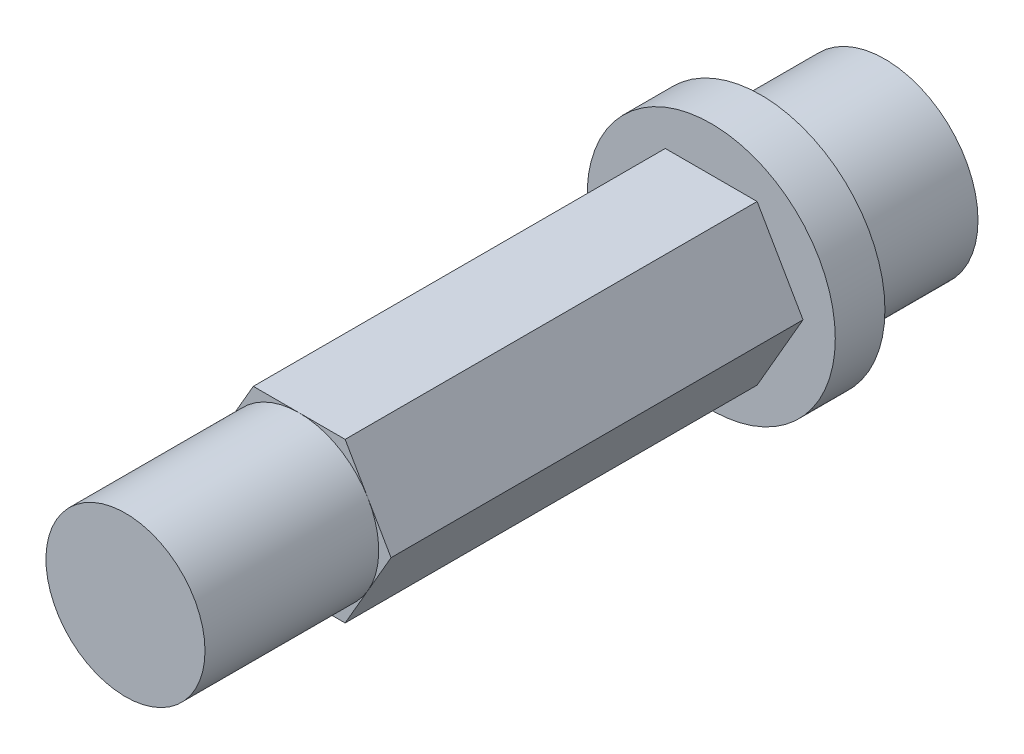
ISO-10303-21;
HEADER;
FILE_DESCRIPTION(('STEP AP214'),'2;1');
FILE_NAME('part.step','',(''),(''),'','','');
FILE_SCHEMA(('AUTOMOTIVE_DESIGN { 1 0 10303 214 1 1 1 1 }'));
ENDSEC;
DATA;
#1=APPLICATION_CONTEXT('core data for automotive mechanical design processes');
#2=APPLICATION_PROTOCOL_DEFINITION('international standard','automotive_design',2000,#1);
#3=PRODUCT_CONTEXT('',#1,'mechanical');
#4=PRODUCT('Part','Part','',(#3));
#5=PRODUCT_RELATED_PRODUCT_CATEGORY('part','',(#4));
#6=PRODUCT_DEFINITION_FORMATION('','',#4);
#7=PRODUCT_DEFINITION_CONTEXT('part definition',#1,'design');
#8=PRODUCT_DEFINITION('design','',#6,#7);
#9=PRODUCT_DEFINITION_SHAPE('','',#8);
#10=(LENGTH_UNIT() NAMED_UNIT(*) SI_UNIT(.MILLI.,.METRE.));
#11=(NAMED_UNIT(*) PLANE_ANGLE_UNIT() SI_UNIT($,.RADIAN.));
#12=(NAMED_UNIT(*) SI_UNIT($,.STERADIAN.) SOLID_ANGLE_UNIT());
#13=UNCERTAINTY_MEASURE_WITH_UNIT(LENGTH_MEASURE(1.E-05),#10,'distance_accuracy_value','');
#14=(GEOMETRIC_REPRESENTATION_CONTEXT(3) GLOBAL_UNCERTAINTY_ASSIGNED_CONTEXT((#13)) GLOBAL_UNIT_ASSIGNED_CONTEXT((#10,
#11,#12)) REPRESENTATION_CONTEXT('',''));
#15=CARTESIAN_POINT('',(0.,0.,0.));
#16=DIRECTION('',(0.,0.,1.));
#17=DIRECTION('',(1.,0.,0.));
#18=AXIS2_PLACEMENT_3D('',#15,#16,#17);
#19=CARTESIAN_POINT('',(0.,0.,23.6));
#20=DIRECTION('',(0.,0.,1.));
#21=DIRECTION('',(1.,0.,0.));
#22=AXIS2_PLACEMENT_3D('',#19,#20,#21);
#23=PLANE('',#22);
#24=CARTESIAN_POINT('',(0.,0.,23.6));
#25=DIRECTION('',(0.,0.,1.));
#26=DIRECTION('',(1.,0.,0.));
#27=AXIS2_PLACEMENT_3D('',#24,#25,#26);
#28=CIRCLE('',#27,3.20429399400242);
#29=CARTESIAN_POINT('',(2.775,1.60214699700121,23.6));
#30=VERTEX_POINT('',#29);
#31=CARTESIAN_POINT('',(0.,3.20429399400243,23.6));
#32=VERTEX_POINT('',#31);
#33=EDGE_CURVE('E51',#30,#32,#28,.T.);
#34=ORIENTED_EDGE('',*,*,#33,.F.);
#35=DIRECTION('',(-0.5,0.866025403784439,0.));
#36=VECTOR('',#35,1.);
#37=CARTESIAN_POINT('',(3.7,0.,23.6));
#38=LINE('',#37,#36);
#39=CARTESIAN_POINT('',(1.85,3.20429399400242,23.6));
#40=VERTEX_POINT('',#39);
#41=EDGE_CURVE('E127',#30,#40,#38,.T.);
#42=ORIENTED_EDGE('',*,*,#41,.T.);
#43=DIRECTION('',(-1.,0.,0.));
#44=VECTOR('',#43,1.);
#45=CARTESIAN_POINT('',(1.85,3.20429399400242,23.6));
#46=LINE('',#45,#44);
#47=EDGE_CURVE('E141',#40,#32,#46,.T.);
#48=ORIENTED_EDGE('',*,*,#47,.T.);
#49=EDGE_LOOP('',(#34,#42,#48));
#50=FACE_BOUND('',#49,.T.);
#51=ADVANCED_FACE('F39',(#50),#23,.T.);
#52=CARTESIAN_POINT('',(-2.775,1.60214699700121,23.6));
#53=VERTEX_POINT('',#52);
#54=EDGE_CURVE('E11',#32,#53,#28,.T.);
#55=ORIENTED_EDGE('',*,*,#54,.F.);
#56=CARTESIAN_POINT('',(-1.85,3.20429399400243,23.6));
#57=VERTEX_POINT('',#56);
#58=EDGE_CURVE('E126',#32,#57,#46,.T.);
#59=ORIENTED_EDGE('',*,*,#58,.T.);
#60=DIRECTION('',(-0.5,-0.866025403784439,0.));
#61=VECTOR('',#60,1.);
#62=CARTESIAN_POINT('',(-1.85,3.20429399400243,23.6));
#63=LINE('',#62,#61);
#64=EDGE_CURVE('E158',#57,#53,#63,.T.);
#65=ORIENTED_EDGE('',*,*,#64,.T.);
#66=EDGE_LOOP('',(#55,#59,#65));
#67=FACE_BOUND('',#66,.T.);
#68=ADVANCED_FACE('F242',(#67),#23,.T.);
#69=CARTESIAN_POINT('',(-2.775,-1.60214699700121,23.6));
#70=VERTEX_POINT('',#69);
#71=EDGE_CURVE('E49',#53,#70,#28,.T.);
#72=ORIENTED_EDGE('',*,*,#71,.F.);
#73=CARTESIAN_POINT('',(-3.7,0.,23.6));
#74=VERTEX_POINT('',#73);
#75=EDGE_CURVE('E157',#53,#74,#63,.T.);
#76=ORIENTED_EDGE('',*,*,#75,.T.);
#77=DIRECTION('',(0.5,-0.866025403784439,0.));
#78=VECTOR('',#77,1.);
#79=CARTESIAN_POINT('',(-3.7,0.,23.6));
#80=LINE('',#79,#78);
#81=EDGE_CURVE('E163',#74,#70,#80,.T.);
#82=ORIENTED_EDGE('',*,*,#81,.T.);
#83=EDGE_LOOP('',(#72,#76,#82));
#84=FACE_BOUND('',#83,.T.);
#85=ADVANCED_FACE('F247',(#84),#23,.T.);
#86=CARTESIAN_POINT('',(0.,-3.20429399400242,23.6));
#87=VERTEX_POINT('',#86);
#88=EDGE_CURVE('E66',#70,#87,#28,.T.);
#89=ORIENTED_EDGE('',*,*,#88,.F.);
#90=CARTESIAN_POINT('',(-1.85,-3.20429399400242,23.6));
#91=VERTEX_POINT('',#90);
#92=EDGE_CURVE('E162',#70,#91,#80,.T.);
#93=ORIENTED_EDGE('',*,*,#92,.T.);
#94=DIRECTION('',(1.,0.,0.));
#95=VECTOR('',#94,1.);
#96=CARTESIAN_POINT('',(-1.85,-3.20429399400242,23.6));
#97=LINE('',#96,#95);
#98=EDGE_CURVE('E168',#91,#87,#97,.T.);
#99=ORIENTED_EDGE('',*,*,#98,.T.);
#100=EDGE_LOOP('',(#89,#93,#99));
#101=FACE_BOUND('',#100,.T.);
#102=ADVANCED_FACE('F263',(#101),#23,.T.);
#103=CARTESIAN_POINT('',(2.775,-1.60214699700121,23.6));
#104=VERTEX_POINT('',#103);
#105=EDGE_CURVE('E58',#87,#104,#28,.T.);
#106=ORIENTED_EDGE('',*,*,#105,.F.);
#107=CARTESIAN_POINT('',(1.85,-3.20429399400243,23.6));
#108=VERTEX_POINT('',#107);
#109=EDGE_CURVE('E167',#87,#108,#97,.T.);
#110=ORIENTED_EDGE('',*,*,#109,.T.);
#111=DIRECTION('',(0.5,0.866025403784439,0.));
#112=VECTOR('',#111,1.);
#113=CARTESIAN_POINT('',(1.85,-3.20429399400243,23.6));
#114=LINE('',#113,#112);
#115=EDGE_CURVE('E139',#108,#104,#114,.T.);
#116=ORIENTED_EDGE('',*,*,#115,.T.);
#117=EDGE_LOOP('',(#106,#110,#116));
#118=FACE_BOUND('',#117,.T.);
#119=ADVANCED_FACE('F253',(#118),#23,.T.);
#120=CARTESIAN_POINT('',(0.,0.,5.));
#121=DIRECTION('',(0.,0.,-1.));
#122=DIRECTION('',(-1.,0.,0.));
#123=AXIS2_PLACEMENT_3D('',#120,#121,#122);
#124=CYLINDRICAL_SURFACE('',#123,3.75);
#125=CARTESIAN_POINT('',(0.,0.,5.));
#126=DIRECTION('',(0.,0.,1.));
#127=DIRECTION('',(1.,0.,0.));
#128=AXIS2_PLACEMENT_3D('',#125,#126,#127);
#129=CIRCLE('',#128,3.75);
#130=CARTESIAN_POINT('',(3.75,0.,5.));
#131=VERTEX_POINT('',#130);
#132=EDGE_CURVE('E147',#131,#131,#129,.T.);
#133=ORIENTED_EDGE('',*,*,#132,.F.);
#134=EDGE_LOOP('',(#133));
#135=FACE_BOUND('',#134,.T.);
#136=CARTESIAN_POINT('',(0.,0.,0.));
#137=DIRECTION('',(0.,0.,1.));
#138=DIRECTION('',(1.,0.,0.));
#139=AXIS2_PLACEMENT_3D('',#136,#137,#138);
#140=CIRCLE('',#139,3.75);
#141=CARTESIAN_POINT('',(3.75,0.,0.));
#142=VERTEX_POINT('',#141);
#143=EDGE_CURVE('E43',#142,#142,#140,.T.);
#144=ORIENTED_EDGE('',*,*,#143,.T.);
#145=EDGE_LOOP('',(#144));
#146=FACE_BOUND('',#145,.T.);
#147=ADVANCED_FACE('F41',(#135,#146),#124,.T.);
#148=CARTESIAN_POINT('',(0.,0.,0.));
#149=DIRECTION('',(0.,0.,1.));
#150=DIRECTION('',(1.,0.,0.));
#151=AXIS2_PLACEMENT_3D('',#148,#149,#150);
#152=PLANE('',#151);
#153=ORIENTED_EDGE('',*,*,#143,.F.);
#154=EDGE_LOOP('',(#153));
#155=FACE_BOUND('',#154,.T.);
#156=ADVANCED_FACE('F268',(#155),#152,.F.);
#157=CARTESIAN_POINT('',(0.,0.,7.));
#158=DIRECTION('',(0.,0.,-1.));
#159=DIRECTION('',(-1.,0.,0.));
#160=AXIS2_PLACEMENT_3D('',#157,#158,#159);
#161=CYLINDRICAL_SURFACE('',#160,5.);
#162=CARTESIAN_POINT('',(0.,0.,7.));
#163=DIRECTION('',(0.,0.,1.));
#164=DIRECTION('',(1.,0.,0.));
#165=AXIS2_PLACEMENT_3D('',#162,#163,#164);
#166=CIRCLE('',#165,5.);
#167=CARTESIAN_POINT('',(5.,0.,7.));
#168=VERTEX_POINT('',#167);
#169=EDGE_CURVE('E216',#168,#168,#166,.T.);
#170=ORIENTED_EDGE('',*,*,#169,.F.);
#171=EDGE_LOOP('',(#170));
#172=FACE_BOUND('',#171,.T.);
#173=CARTESIAN_POINT('',(0.,0.,5.));
#174=DIRECTION('',(0.,0.,1.));
#175=DIRECTION('',(1.,0.,0.));
#176=AXIS2_PLACEMENT_3D('',#173,#174,#175);
#177=CIRCLE('',#176,5.);
#178=CARTESIAN_POINT('',(5.,0.,5.));
#179=VERTEX_POINT('',#178);
#180=EDGE_CURVE('E215',#179,#179,#177,.T.);
#181=ORIENTED_EDGE('',*,*,#180,.T.);
#182=EDGE_LOOP('',(#181));
#183=FACE_BOUND('',#182,.T.);
#184=ADVANCED_FACE('F224',(#172,#183),#161,.T.);
#185=CARTESIAN_POINT('',(0.,0.,7.));
#186=DIRECTION('',(0.,0.,1.));
#187=DIRECTION('',(1.,0.,0.));
#188=AXIS2_PLACEMENT_3D('',#185,#186,#187);
#189=PLANE('',#188);
#190=DIRECTION('',(0.5,0.866025403784439,0.));
#191=VECTOR('',#190,1.);
#192=CARTESIAN_POINT('',(1.85,-3.20429399400243,7.));
#193=LINE('',#192,#191);
#194=CARTESIAN_POINT('',(1.85,-3.20429399400243,7.));
#195=VERTEX_POINT('',#194);
#196=CARTESIAN_POINT('',(3.7,0.,7.));
#197=VERTEX_POINT('',#196);
#198=EDGE_CURVE('E172',#195,#197,#193,.T.);
#199=ORIENTED_EDGE('',*,*,#198,.F.);
#200=DIRECTION('',(1.,0.,0.));
#201=VECTOR('',#200,1.);
#202=CARTESIAN_POINT('',(-1.85,-3.20429399400242,7.));
#203=LINE('',#202,#201);
#204=CARTESIAN_POINT('',(-1.85,-3.20429399400242,7.));
#205=VERTEX_POINT('',#204);
#206=EDGE_CURVE('E191',#205,#195,#203,.T.);
#207=ORIENTED_EDGE('',*,*,#206,.F.);
#208=DIRECTION('',(0.5,-0.866025403784439,0.));
#209=VECTOR('',#208,1.);
#210=CARTESIAN_POINT('',(-3.7,0.,7.));
#211=LINE('',#210,#209);
#212=CARTESIAN_POINT('',(-3.7,0.,7.));
#213=VERTEX_POINT('',#212);
#214=EDGE_CURVE('E187',#213,#205,#211,.T.);
#215=ORIENTED_EDGE('',*,*,#214,.F.);
#216=DIRECTION('',(-0.5,-0.866025403784439,0.));
#217=VECTOR('',#216,1.);
#218=CARTESIAN_POINT('',(-1.85,3.20429399400243,7.));
#219=LINE('',#218,#217);
#220=CARTESIAN_POINT('',(-1.85,3.20429399400243,7.));
#221=VERTEX_POINT('',#220);
#222=EDGE_CURVE('E183',#221,#213,#219,.T.);
#223=ORIENTED_EDGE('',*,*,#222,.F.);
#224=DIRECTION('',(-1.,0.,0.));
#225=VECTOR('',#224,1.);
#226=CARTESIAN_POINT('',(1.85,3.20429399400242,7.));
#227=LINE('',#226,#225);
#228=CARTESIAN_POINT('',(1.85,3.20429399400242,7.));
#229=VERTEX_POINT('',#228);
#230=EDGE_CURVE('E179',#229,#221,#227,.T.);
#231=ORIENTED_EDGE('',*,*,#230,.F.);
#232=DIRECTION('',(-0.5,0.866025403784439,0.));
#233=VECTOR('',#232,1.);
#234=CARTESIAN_POINT('',(3.7,0.,7.));
#235=LINE('',#234,#233);
#236=EDGE_CURVE('E176',#197,#229,#235,.T.);
#237=ORIENTED_EDGE('',*,*,#236,.F.);
#238=EDGE_LOOP('',(#199,#207,#215,#223,#231,#237));
#239=FACE_BOUND('',#238,.T.);
#240=ORIENTED_EDGE('',*,*,#169,.T.);
#241=EDGE_LOOP('',(#240));
#242=FACE_BOUND('',#241,.T.);
#243=ADVANCED_FACE('F229',(#239,#242),#189,.T.);
#244=CARTESIAN_POINT('',(0.,0.,5.));
#245=DIRECTION('',(0.,0.,1.));
#246=DIRECTION('',(1.,0.,0.));
#247=AXIS2_PLACEMENT_3D('',#244,#245,#246);
#248=PLANE('',#247);
#249=ORIENTED_EDGE('',*,*,#132,.T.);
#250=EDGE_LOOP('',(#249));
#251=FACE_BOUND('',#250,.T.);
#252=ORIENTED_EDGE('',*,*,#180,.F.);
#253=EDGE_LOOP('',(#252));
#254=FACE_BOUND('',#253,.T.);
#255=ADVANCED_FACE('F226',(#251,#254),#248,.F.);
#256=CARTESIAN_POINT('',(1.85,-3.20429399400243,23.6));
#257=DIRECTION('',(-0.866025403784438,0.5,0.));
#258=DIRECTION('',(-0.5,-0.866025403784439,0.));
#259=AXIS2_PLACEMENT_3D('',#256,#257,#258);
#260=PLANE('',#259);
#261=ORIENTED_EDGE('',*,*,#198,.T.);
#262=DIRECTION('',(0.,0.,-1.));
#263=VECTOR('',#262,1.);
#264=CARTESIAN_POINT('',(3.7,0.,23.6));
#265=LINE('',#264,#263);
#266=CARTESIAN_POINT('',(3.7,0.,23.6));
#267=VERTEX_POINT('',#266);
#268=EDGE_CURVE('E212',#267,#197,#265,.T.);
#269=ORIENTED_EDGE('',*,*,#268,.F.);
#270=EDGE_CURVE('E121',#104,#267,#114,.T.);
#271=ORIENTED_EDGE('',*,*,#270,.F.);
#272=ORIENTED_EDGE('',*,*,#115,.F.);
#273=DIRECTION('',(0.,0.,-1.));
#274=VECTOR('',#273,1.);
#275=CARTESIAN_POINT('',(1.85,-3.20429399400243,23.6));
#276=LINE('',#275,#274);
#277=EDGE_CURVE('E171',#108,#195,#276,.T.);
#278=ORIENTED_EDGE('',*,*,#277,.T.);
#279=EDGE_LOOP('',(#261,#269,#271,#272,#278));
#280=FACE_BOUND('',#279,.T.);
#281=ADVANCED_FACE('F228',(#280),#260,.F.);
#282=CARTESIAN_POINT('',(3.7,0.,23.6));
#283=DIRECTION('',(-0.866025403784439,-0.5,0.));
#284=DIRECTION('',(0.5,-0.866025403784439,0.));
#285=AXIS2_PLACEMENT_3D('',#282,#283,#284);
#286=PLANE('',#285);
#287=ORIENTED_EDGE('',*,*,#236,.T.);
#288=DIRECTION('',(0.,0.,-1.));
#289=VECTOR('',#288,1.);
#290=CARTESIAN_POINT('',(1.85,3.20429399400242,23.6));
#291=LINE('',#290,#289);
#292=EDGE_CURVE('E134',#40,#229,#291,.T.);
#293=ORIENTED_EDGE('',*,*,#292,.F.);
#294=ORIENTED_EDGE('',*,*,#41,.F.);
#295=EDGE_CURVE('E115',#267,#30,#38,.T.);
#296=ORIENTED_EDGE('',*,*,#295,.F.);
#297=ORIENTED_EDGE('',*,*,#268,.T.);
#298=EDGE_LOOP('',(#287,#293,#294,#296,#297));
#299=FACE_BOUND('',#298,.T.);
#300=ADVANCED_FACE('F132',(#299),#286,.F.);
#301=CARTESIAN_POINT('',(1.85,3.20429399400242,23.6));
#302=DIRECTION('',(0.,-1.,0.));
#303=DIRECTION('',(1.,0.,0.));
#304=AXIS2_PLACEMENT_3D('',#301,#302,#303);
#305=PLANE('',#304);
#306=ORIENTED_EDGE('',*,*,#230,.T.);
#307=DIRECTION('',(0.,0.,-1.));
#308=VECTOR('',#307,1.);
#309=CARTESIAN_POINT('',(-1.85,3.20429399400243,23.6));
#310=LINE('',#309,#308);
#311=EDGE_CURVE('E206',#57,#221,#310,.T.);
#312=ORIENTED_EDGE('',*,*,#311,.F.);
#313=ORIENTED_EDGE('',*,*,#58,.F.);
#314=ORIENTED_EDGE('',*,*,#47,.F.);
#315=ORIENTED_EDGE('',*,*,#292,.T.);
#316=EDGE_LOOP('',(#306,#312,#313,#314,#315));
#317=FACE_BOUND('',#316,.T.);
#318=ADVANCED_FACE('F289',(#317),#305,.F.);
#319=CARTESIAN_POINT('',(-1.85,3.20429399400243,23.6));
#320=DIRECTION('',(0.866025403784439,-0.5,0.));
#321=DIRECTION('',(0.5,0.866025403784439,0.));
#322=AXIS2_PLACEMENT_3D('',#319,#320,#321);
#323=PLANE('',#322);
#324=ORIENTED_EDGE('',*,*,#222,.T.);
#325=DIRECTION('',(0.,0.,-1.));
#326=VECTOR('',#325,1.);
#327=CARTESIAN_POINT('',(-3.7,0.,23.6));
#328=LINE('',#327,#326);
#329=EDGE_CURVE('E202',#74,#213,#328,.T.);
#330=ORIENTED_EDGE('',*,*,#329,.F.);
#331=ORIENTED_EDGE('',*,*,#75,.F.);
#332=ORIENTED_EDGE('',*,*,#64,.F.);
#333=ORIENTED_EDGE('',*,*,#311,.T.);
#334=EDGE_LOOP('',(#324,#330,#331,#332,#333));
#335=FACE_BOUND('',#334,.T.);
#336=ADVANCED_FACE('F283',(#335),#323,.F.);
#337=CARTESIAN_POINT('',(-3.7,0.,23.6));
#338=DIRECTION('',(0.866025403784439,0.5,0.));
#339=DIRECTION('',(-0.5,0.866025403784439,0.));
#340=AXIS2_PLACEMENT_3D('',#337,#338,#339);
#341=PLANE('',#340);
#342=ORIENTED_EDGE('',*,*,#214,.T.);
#343=DIRECTION('',(0.,0.,-1.));
#344=VECTOR('',#343,1.);
#345=CARTESIAN_POINT('',(-1.85,-3.20429399400242,23.6));
#346=LINE('',#345,#344);
#347=EDGE_CURVE('E198',#91,#205,#346,.T.);
#348=ORIENTED_EDGE('',*,*,#347,.F.);
#349=ORIENTED_EDGE('',*,*,#92,.F.);
#350=ORIENTED_EDGE('',*,*,#81,.F.);
#351=ORIENTED_EDGE('',*,*,#329,.T.);
#352=EDGE_LOOP('',(#342,#348,#349,#350,#351));
#353=FACE_BOUND('',#352,.T.);
#354=ADVANCED_FACE('F260',(#353),#341,.F.);
#355=CARTESIAN_POINT('',(-1.85,-3.20429399400242,23.6));
#356=DIRECTION('',(0.,1.,0.));
#357=DIRECTION('',(-1.,0.,0.));
#358=AXIS2_PLACEMENT_3D('',#355,#356,#357);
#359=PLANE('',#358);
#360=ORIENTED_EDGE('',*,*,#206,.T.);
#361=ORIENTED_EDGE('',*,*,#277,.F.);
#362=ORIENTED_EDGE('',*,*,#109,.F.);
#363=ORIENTED_EDGE('',*,*,#98,.F.);
#364=ORIENTED_EDGE('',*,*,#347,.T.);
#365=EDGE_LOOP('',(#360,#361,#362,#363,#364));
#366=FACE_BOUND('',#365,.T.);
#367=ADVANCED_FACE('F252',(#366),#359,.F.);
#368=EDGE_CURVE('E119',#104,#30,#28,.T.);
#369=ORIENTED_EDGE('',*,*,#368,.F.);
#370=ORIENTED_EDGE('',*,*,#270,.T.);
#371=ORIENTED_EDGE('',*,*,#295,.T.);
#372=EDGE_LOOP('',(#369,#370,#371));
#373=FACE_BOUND('',#372,.T.);
#374=ADVANCED_FACE('F117',(#373),#23,.T.);
#375=CARTESIAN_POINT('',(0.,0.,30.6));
#376=DIRECTION('',(0.,0.,-1.));
#377=DIRECTION('',(-1.,0.,0.));
#378=AXIS2_PLACEMENT_3D('',#375,#376,#377);
#379=CYLINDRICAL_SURFACE('',#378,3.20429399400242);
#380=CARTESIAN_POINT('',(0.,0.,30.6));
#381=DIRECTION('',(0.,0.,1.));
#382=DIRECTION('',(1.,0.,0.));
#383=AXIS2_PLACEMENT_3D('',#380,#381,#382);
#384=CIRCLE('',#383,3.20429399400242);
#385=CARTESIAN_POINT('',(3.20429399400242,0.,30.6));
#386=VERTEX_POINT('',#385);
#387=EDGE_CURVE('E144',#386,#386,#384,.T.);
#388=ORIENTED_EDGE('',*,*,#387,.F.);
#389=EDGE_LOOP('',(#388));
#390=FACE_BOUND('',#389,.T.);
#391=ORIENTED_EDGE('',*,*,#33,.T.);
#392=ORIENTED_EDGE('',*,*,#54,.T.);
#393=ORIENTED_EDGE('',*,*,#71,.T.);
#394=ORIENTED_EDGE('',*,*,#88,.T.);
#395=ORIENTED_EDGE('',*,*,#105,.T.);
#396=ORIENTED_EDGE('',*,*,#368,.T.);
#397=EDGE_LOOP('',(#391,#392,#393,#394,#395,#396));
#398=FACE_BOUND('',#397,.T.);
#399=ADVANCED_FACE('F145',(#390,#398),#379,.T.);
#400=CARTESIAN_POINT('',(0.,0.,30.6));
#401=DIRECTION('',(0.,0.,1.));
#402=DIRECTION('',(1.,0.,0.));
#403=AXIS2_PLACEMENT_3D('',#400,#401,#402);
#404=PLANE('',#403);
#405=ORIENTED_EDGE('',*,*,#387,.T.);
#406=EDGE_LOOP('',(#405));
#407=FACE_BOUND('',#406,.T.);
#408=ADVANCED_FACE('F258',(#407),#404,.T.);
#409=CLOSED_SHELL('',(#51,#68,#85,#102,#119,#147,#156,#184,#243,#255,#281,#300,#318,#336,#354,
#367,#374,#399,#408));
#410=MANIFOLD_SOLID_BREP('B2',#409);
#411=ADVANCED_BREP_SHAPE_REPRESENTATION('',(#18,#410),#14);
#412=SHAPE_DEFINITION_REPRESENTATION(#9,#411);
ENDSEC;
END-ISO-10303-21;
